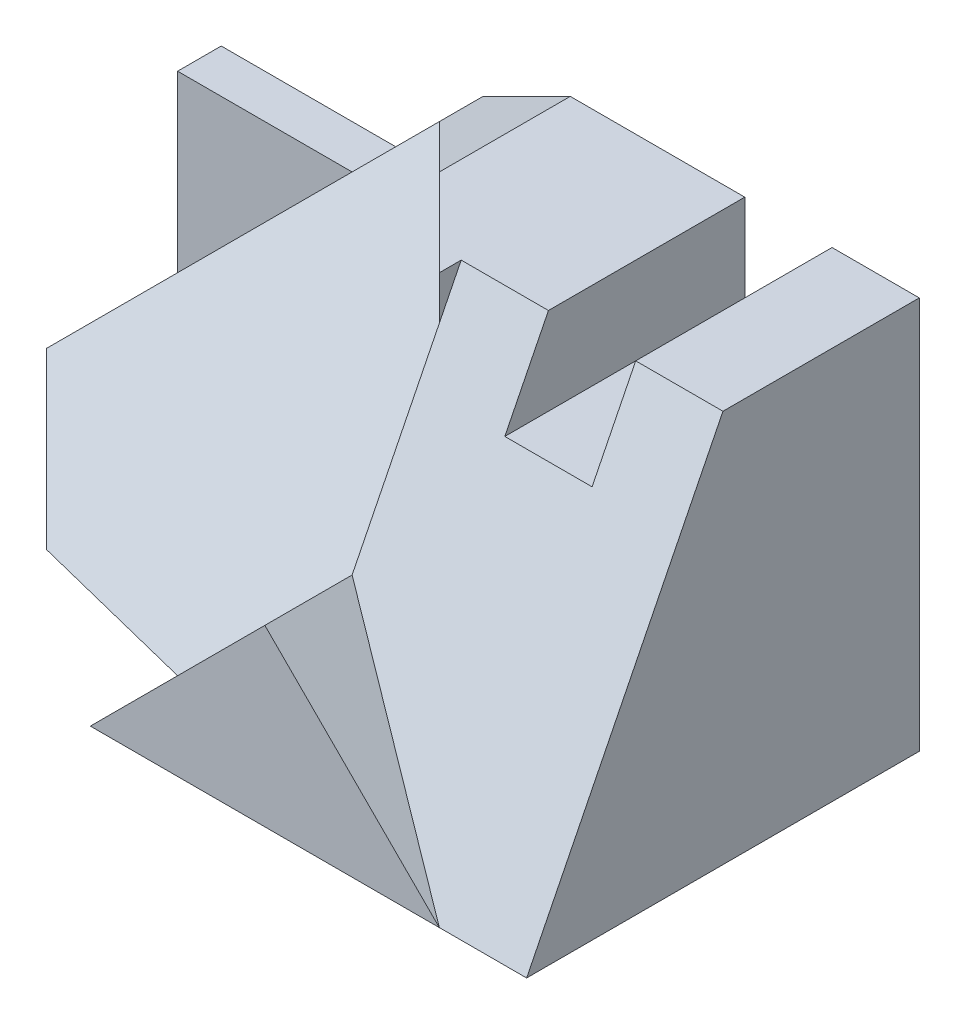
ISO-10303-21;
HEADER;
FILE_DESCRIPTION(('STEP AP214'),'2;1');
FILE_NAME('part.step','',(''),(''),'','','');
FILE_SCHEMA(('AUTOMOTIVE_DESIGN { 1 0 10303 214 1 1 1 1 }'));
ENDSEC;
DATA;
#1=APPLICATION_CONTEXT('core data for automotive mechanical design processes');
#2=APPLICATION_PROTOCOL_DEFINITION('international standard','automotive_design',2000,#1);
#3=PRODUCT_CONTEXT('',#1,'mechanical');
#4=PRODUCT('Part','Part','',(#3));
#5=PRODUCT_RELATED_PRODUCT_CATEGORY('part','',(#4));
#6=PRODUCT_DEFINITION_FORMATION('','',#4);
#7=PRODUCT_DEFINITION_CONTEXT('part definition',#1,'design');
#8=PRODUCT_DEFINITION('design','',#6,#7);
#9=PRODUCT_DEFINITION_SHAPE('','',#8);
#10=(LENGTH_UNIT() NAMED_UNIT(*) SI_UNIT(.MILLI.,.METRE.));
#11=(NAMED_UNIT(*) PLANE_ANGLE_UNIT() SI_UNIT($,.RADIAN.));
#12=(NAMED_UNIT(*) SI_UNIT($,.STERADIAN.) SOLID_ANGLE_UNIT());
#13=UNCERTAINTY_MEASURE_WITH_UNIT(LENGTH_MEASURE(1.E-05),#10,'distance_accuracy_value','');
#14=(GEOMETRIC_REPRESENTATION_CONTEXT(3) GLOBAL_UNCERTAINTY_ASSIGNED_CONTEXT((#13)) GLOBAL_UNIT_ASSIGNED_CONTEXT((#10,
#11,#12)) REPRESENTATION_CONTEXT('',''));
#15=CARTESIAN_POINT('',(0.,0.,0.));
#16=DIRECTION('',(0.,0.,1.));
#17=DIRECTION('',(1.,0.,0.));
#18=AXIS2_PLACEMENT_3D('',#15,#16,#17);
#19=CARTESIAN_POINT('',(0.,9.,4.5));
#20=DIRECTION('',(0.,0.,-1.));
#21=DIRECTION('',(-1.,0.,0.));
#22=AXIS2_PLACEMENT_3D('',#19,#20,#21);
#23=PLANE('',#22);
#24=DIRECTION('',(0.707106781186548,0.707106781186548,0.));
#25=VECTOR('',#24,1.);
#26=CARTESIAN_POINT('',(-2.,0.,4.5));
#27=LINE('',#26,#25);
#28=CARTESIAN_POINT('',(-2.,0.,4.5));
#29=VERTEX_POINT('',#28);
#30=CARTESIAN_POINT('',(2.,4.,4.5));
#31=VERTEX_POINT('',#30);
#32=EDGE_CURVE('E261',#29,#31,#27,.T.);
#33=ORIENTED_EDGE('',*,*,#32,.F.);
#34=DIRECTION('',(1.,0.,0.));
#35=VECTOR('',#34,1.);
#36=CARTESIAN_POINT('',(0.,0.,4.5));
#37=LINE('',#36,#35);
#38=CARTESIAN_POINT('',(6.,0.,4.5));
#39=VERTEX_POINT('',#38);
#40=EDGE_CURVE('E206',#29,#39,#37,.T.);
#41=ORIENTED_EDGE('',*,*,#40,.T.);
#42=DIRECTION('',(0.707106781186548,-0.707106781186548,0.));
#43=VECTOR('',#42,1.);
#44=CARTESIAN_POINT('',(-1.5,7.5,4.5));
#45=LINE('',#44,#43);
#46=EDGE_CURVE('E260',#31,#39,#45,.T.);
#47=ORIENTED_EDGE('',*,*,#46,.F.);
#48=EDGE_LOOP('',(#33,#41,#47));
#49=FACE_BOUND('',#48,.T.);
#50=ADVANCED_FACE('F38',(#49),#23,.F.);
#51=CARTESIAN_POINT('',(0.,9.,0.));
#52=DIRECTION('',(0.,1.,0.));
#53=DIRECTION('',(0.,0.,1.));
#54=AXIS2_PLACEMENT_3D('',#51,#52,#53);
#55=PLANE('',#54);
#56=DIRECTION('',(0.,0.,1.));
#57=VECTOR('',#56,1.);
#58=CARTESIAN_POINT('',(6.,9.,-4.5));
#59=LINE('',#58,#57);
#60=CARTESIAN_POINT('',(6.,9.,-4.5));
#61=VERTEX_POINT('',#60);
#62=CARTESIAN_POINT('',(6.,9.,0.));
#63=VERTEX_POINT('',#62);
#64=EDGE_CURVE('E357',#61,#63,#59,.T.);
#65=ORIENTED_EDGE('',*,*,#64,.T.);
#66=DIRECTION('',(1.,0.,0.));
#67=VECTOR('',#66,1.);
#68=CARTESIAN_POINT('',(2.,9.,0.));
#69=LINE('',#68,#67);
#70=CARTESIAN_POINT('',(8.,9.,0.));
#71=VERTEX_POINT('',#70);
#72=EDGE_CURVE('E295',#63,#71,#69,.T.);
#73=ORIENTED_EDGE('',*,*,#72,.T.);
#74=DIRECTION('',(0.,0.,-1.));
#75=VECTOR('',#74,1.);
#76=CARTESIAN_POINT('',(8.,9.,0.));
#77=LINE('',#76,#75);
#78=CARTESIAN_POINT('',(8.,9.,-4.5));
#79=VERTEX_POINT('',#78);
#80=EDGE_CURVE('E243',#71,#79,#77,.T.);
#81=ORIENTED_EDGE('',*,*,#80,.T.);
#82=DIRECTION('',(1.,0.,0.));
#83=VECTOR('',#82,1.);
#84=CARTESIAN_POINT('',(0.,9.,-4.5));
#85=LINE('',#84,#83);
#86=EDGE_CURVE('E240',#61,#79,#85,.T.);
#87=ORIENTED_EDGE('',*,*,#86,.F.);
#88=EDGE_LOOP('',(#65,#73,#81,#87));
#89=FACE_BOUND('',#88,.T.);
#90=ADVANCED_FACE('F393',(#89),#55,.T.);
#91=CARTESIAN_POINT('',(8.,9.,0.));
#92=DIRECTION('',(-1.,0.,0.));
#93=DIRECTION('',(0.,0.,1.));
#94=AXIS2_PLACEMENT_3D('',#91,#92,#93);
#95=PLANE('',#94);
#96=DIRECTION('',(0.,-0.894427190999916,0.447213595499958));
#97=VECTOR('',#96,1.);
#98=CARTESIAN_POINT('',(8.,9.,0.));
#99=LINE('',#98,#97);
#100=CARTESIAN_POINT('',(8.,0.,4.5));
#101=VERTEX_POINT('',#100);
#102=EDGE_CURVE('E268',#71,#101,#99,.T.);
#103=ORIENTED_EDGE('',*,*,#102,.T.);
#104=DIRECTION('',(0.,0.,-1.));
#105=VECTOR('',#104,1.);
#106=CARTESIAN_POINT('',(8.,0.,0.));
#107=LINE('',#106,#105);
#108=CARTESIAN_POINT('',(8.,0.,-4.5));
#109=VERTEX_POINT('',#108);
#110=EDGE_CURVE('E247',#101,#109,#107,.T.);
#111=ORIENTED_EDGE('',*,*,#110,.T.);
#112=DIRECTION('',(0.,-1.,0.));
#113=VECTOR('',#112,1.);
#114=CARTESIAN_POINT('',(8.,9.,-4.5));
#115=LINE('',#114,#113);
#116=EDGE_CURVE('E46',#79,#109,#115,.T.);
#117=ORIENTED_EDGE('',*,*,#116,.F.);
#118=ORIENTED_EDGE('',*,*,#80,.F.);
#119=EDGE_LOOP('',(#103,#111,#117,#118));
#120=FACE_BOUND('',#119,.T.);
#121=ADVANCED_FACE('F392',(#120),#95,.F.);
#122=DIRECTION('',(-0.707106781186548,0.,-0.707106781186548));
#123=VECTOR('',#122,1.);
#124=CARTESIAN_POINT('',(0.75,9.,-0.75));
#125=LINE('',#124,#123);
#126=CARTESIAN_POINT('',(2.,9.,0.5));
#127=VERTEX_POINT('',#126);
#128=CARTESIAN_POINT('',(0.,9.,-1.5));
#129=VERTEX_POINT('',#128);
#130=EDGE_CURVE('E163',#127,#129,#125,.T.);
#131=ORIENTED_EDGE('',*,*,#130,.F.);
#132=DIRECTION('',(0.,0.,1.));
#133=VECTOR('',#132,1.);
#134=CARTESIAN_POINT('',(2.,9.,0.));
#135=LINE('',#134,#133);
#136=CARTESIAN_POINT('',(2.,9.,0.));
#137=VERTEX_POINT('',#136);
#138=EDGE_CURVE('E291',#137,#127,#135,.T.);
#139=ORIENTED_EDGE('',*,*,#138,.F.);
#140=CARTESIAN_POINT('',(4.,9.,0.));
#141=VERTEX_POINT('',#140);
#142=EDGE_CURVE('E285',#137,#141,#69,.T.);
#143=ORIENTED_EDGE('',*,*,#142,.T.);
#144=DIRECTION('',(0.,0.,1.));
#145=VECTOR('',#144,1.);
#146=CARTESIAN_POINT('',(4.,9.,-4.5));
#147=LINE('',#146,#145);
#148=CARTESIAN_POINT('',(4.,9.,-4.5));
#149=VERTEX_POINT('',#148);
#150=EDGE_CURVE('E349',#149,#141,#147,.T.);
#151=ORIENTED_EDGE('',*,*,#150,.F.);
#152=CARTESIAN_POINT('',(0.,9.,-4.5));
#153=VERTEX_POINT('',#152);
#154=EDGE_CURVE('E381',#153,#149,#85,.T.);
#155=ORIENTED_EDGE('',*,*,#154,.F.);
#156=DIRECTION('',(0.,0.,1.));
#157=VECTOR('',#156,1.);
#158=CARTESIAN_POINT('',(0.,9.,-4.5));
#159=LINE('',#158,#157);
#160=EDGE_CURVE('E189',#153,#129,#159,.T.);
#161=ORIENTED_EDGE('',*,*,#160,.T.);
#162=EDGE_LOOP('',(#131,#139,#143,#151,#155,#161));
#163=FACE_BOUND('',#162,.T.);
#164=ADVANCED_FACE('F342',(#163),#55,.T.);
#165=CARTESIAN_POINT('',(6.,9.,-4.5));
#166=DIRECTION('',(1.,0.,0.));
#167=DIRECTION('',(0.,0.,-1.));
#168=AXIS2_PLACEMENT_3D('',#165,#166,#167);
#169=PLANE('',#168);
#170=DIRECTION('',(0.,-0.894427190999916,0.447213595499958));
#171=VECTOR('',#170,1.);
#172=CARTESIAN_POINT('',(6.,10.8,-0.899999999999999));
#173=LINE('',#172,#171);
#174=CARTESIAN_POINT('',(6.,7.,1.));
#175=VERTEX_POINT('',#174);
#176=EDGE_CURVE('E395',#63,#175,#173,.T.);
#177=ORIENTED_EDGE('',*,*,#176,.F.);
#178=ORIENTED_EDGE('',*,*,#64,.F.);
#179=DIRECTION('',(0.,1.,0.));
#180=VECTOR('',#179,1.);
#181=CARTESIAN_POINT('',(6.,9.,-4.5));
#182=LINE('',#181,#180);
#183=CARTESIAN_POINT('',(6.,7.,-4.5));
#184=VERTEX_POINT('',#183);
#185=EDGE_CURVE('E192',#184,#61,#182,.T.);
#186=ORIENTED_EDGE('',*,*,#185,.F.);
#187=DIRECTION('',(0.,0.,1.));
#188=VECTOR('',#187,1.);
#189=CARTESIAN_POINT('',(6.,7.,-4.5));
#190=LINE('',#189,#188);
#191=EDGE_CURVE('E219',#184,#175,#190,.T.);
#192=ORIENTED_EDGE('',*,*,#191,.T.);
#193=EDGE_LOOP('',(#177,#178,#186,#192));
#194=FACE_BOUND('',#193,.T.);
#195=ADVANCED_FACE('F398',(#194),#169,.F.);
#196=CARTESIAN_POINT('',(6.,7.,-4.5));
#197=DIRECTION('',(0.,-1.,0.));
#198=DIRECTION('',(1.,0.,0.));
#199=AXIS2_PLACEMENT_3D('',#196,#197,#198);
#200=PLANE('',#199);
#201=DIRECTION('',(-1.,0.,0.));
#202=VECTOR('',#201,1.);
#203=CARTESIAN_POINT('',(6.,7.,1.));
#204=LINE('',#203,#202);
#205=CARTESIAN_POINT('',(4.,7.,1.));
#206=VERTEX_POINT('',#205);
#207=EDGE_CURVE('E53',#175,#206,#204,.T.);
#208=ORIENTED_EDGE('',*,*,#207,.F.);
#209=ORIENTED_EDGE('',*,*,#191,.F.);
#210=DIRECTION('',(1.,0.,0.));
#211=VECTOR('',#210,1.);
#212=CARTESIAN_POINT('',(6.,7.,-4.5));
#213=LINE('',#212,#211);
#214=CARTESIAN_POINT('',(4.,7.,-4.5));
#215=VERTEX_POINT('',#214);
#216=EDGE_CURVE('E361',#215,#184,#213,.T.);
#217=ORIENTED_EDGE('',*,*,#216,.F.);
#218=DIRECTION('',(0.,0.,1.));
#219=VECTOR('',#218,1.);
#220=CARTESIAN_POINT('',(4.,7.,-4.5));
#221=LINE('',#220,#219);
#222=EDGE_CURVE('E356',#215,#206,#221,.T.);
#223=ORIENTED_EDGE('',*,*,#222,.T.);
#224=EDGE_LOOP('',(#208,#209,#217,#223));
#225=FACE_BOUND('',#224,.T.);
#226=ADVANCED_FACE('F410',(#225),#200,.F.);
#227=CARTESIAN_POINT('',(4.,9.,-4.5));
#228=DIRECTION('',(-1.,0.,0.));
#229=DIRECTION('',(0.,-1.,0.));
#230=AXIS2_PLACEMENT_3D('',#227,#228,#229);
#231=PLANE('',#230);
#232=DIRECTION('',(0.,0.894427190999916,-0.447213595499958));
#233=VECTOR('',#232,1.);
#234=CARTESIAN_POINT('',(4.,10.8,-0.899999999999999));
#235=LINE('',#234,#233);
#236=EDGE_CURVE('E12',#206,#141,#235,.T.);
#237=ORIENTED_EDGE('',*,*,#236,.F.);
#238=ORIENTED_EDGE('',*,*,#222,.F.);
#239=DIRECTION('',(0.,-1.,0.));
#240=VECTOR('',#239,1.);
#241=CARTESIAN_POINT('',(4.,9.,-4.5));
#242=LINE('',#241,#240);
#243=EDGE_CURVE('E355',#149,#215,#242,.T.);
#244=ORIENTED_EDGE('',*,*,#243,.F.);
#245=ORIENTED_EDGE('',*,*,#150,.T.);
#246=EDGE_LOOP('',(#237,#238,#244,#245));
#247=FACE_BOUND('',#246,.T.);
#248=ADVANCED_FACE('F352',(#247),#231,.F.);
#249=CARTESIAN_POINT('',(-8.,9.,0.));
#250=DIRECTION('',(-1.,0.,0.));
#251=DIRECTION('',(0.,0.,1.));
#252=AXIS2_PLACEMENT_3D('',#249,#250,#251);
#253=PLANE('',#252);
#254=DIRECTION('',(0.,0.,1.));
#255=VECTOR('',#254,1.);
#256=CARTESIAN_POINT('',(-8.,2.,-4.5));
#257=LINE('',#256,#255);
#258=CARTESIAN_POINT('',(-8.,2.,-4.5));
#259=VERTEX_POINT('',#258);
#260=CARTESIAN_POINT('',(-8.,2.,-3.5));
#261=VERTEX_POINT('',#260);
#262=EDGE_CURVE('E223',#259,#261,#257,.T.);
#263=ORIENTED_EDGE('',*,*,#262,.T.);
#264=DIRECTION('',(0.,-1.,0.));
#265=VECTOR('',#264,1.);
#266=CARTESIAN_POINT('',(-8.,2.,-3.5));
#267=LINE('',#266,#265);
#268=CARTESIAN_POINT('',(-8.,6.,-3.5));
#269=VERTEX_POINT('',#268);
#270=EDGE_CURVE('E378',#269,#261,#267,.T.);
#271=ORIENTED_EDGE('',*,*,#270,.F.);
#272=DIRECTION('',(0.,0.,1.));
#273=VECTOR('',#272,1.);
#274=CARTESIAN_POINT('',(-8.,6.,-4.5));
#275=LINE('',#274,#273);
#276=CARTESIAN_POINT('',(-8.,6.,-4.5));
#277=VERTEX_POINT('',#276);
#278=EDGE_CURVE('E195',#277,#269,#275,.T.);
#279=ORIENTED_EDGE('',*,*,#278,.F.);
#280=DIRECTION('',(0.,-1.,0.));
#281=VECTOR('',#280,1.);
#282=CARTESIAN_POINT('',(-8.,9.,-4.5));
#283=LINE('',#282,#281);
#284=EDGE_CURVE('E377',#277,#259,#283,.T.);
#285=ORIENTED_EDGE('',*,*,#284,.T.);
#286=EDGE_LOOP('',(#263,#271,#279,#285));
#287=FACE_BOUND('',#286,.T.);
#288=ADVANCED_FACE('F376',(#287),#253,.T.);
#289=CARTESIAN_POINT('',(-8.,6.,-4.5));
#290=DIRECTION('',(0.,-1.,0.));
#291=DIRECTION('',(0.,0.,-1.));
#292=AXIS2_PLACEMENT_3D('',#289,#290,#291);
#293=PLANE('',#292);
#294=DIRECTION('',(-1.,0.,0.));
#295=VECTOR('',#294,1.);
#296=CARTESIAN_POINT('',(-8.,6.,-3.5));
#297=LINE('',#296,#295);
#298=CARTESIAN_POINT('',(-4.,6.,-3.5));
#299=VERTEX_POINT('',#298);
#300=EDGE_CURVE('E373',#299,#269,#297,.T.);
#301=ORIENTED_EDGE('',*,*,#300,.F.);
#302=DIRECTION('',(0.,0.,1.));
#303=VECTOR('',#302,1.);
#304=CARTESIAN_POINT('',(-4.,6.,-4.5));
#305=LINE('',#304,#303);
#306=CARTESIAN_POINT('',(-4.,6.,-4.5));
#307=VERTEX_POINT('',#306);
#308=EDGE_CURVE('E190',#307,#299,#305,.T.);
#309=ORIENTED_EDGE('',*,*,#308,.F.);
#310=DIRECTION('',(1.,0.,0.));
#311=VECTOR('',#310,1.);
#312=CARTESIAN_POINT('',(-8.,6.,-4.5));
#313=LINE('',#312,#311);
#314=EDGE_CURVE('E228',#277,#307,#313,.T.);
#315=ORIENTED_EDGE('',*,*,#314,.F.);
#316=ORIENTED_EDGE('',*,*,#278,.T.);
#317=EDGE_LOOP('',(#301,#309,#315,#316));
#318=FACE_BOUND('',#317,.T.);
#319=ADVANCED_FACE('F372',(#318),#293,.F.);
#320=CARTESIAN_POINT('',(0.,9.,-4.5));
#321=DIRECTION('',(0.,0.,-1.));
#322=DIRECTION('',(-1.,0.,0.));
#323=AXIS2_PLACEMENT_3D('',#320,#321,#322);
#324=PLANE('',#323);
#325=ORIENTED_EDGE('',*,*,#185,.T.);
#326=ORIENTED_EDGE('',*,*,#86,.T.);
#327=ORIENTED_EDGE('',*,*,#116,.T.);
#328=DIRECTION('',(1.,0.,0.));
#329=VECTOR('',#328,1.);
#330=CARTESIAN_POINT('',(0.,0.,-4.5));
#331=LINE('',#330,#329);
#332=CARTESIAN_POINT('',(-6.,0.,-4.5));
#333=VERTEX_POINT('',#332);
#334=EDGE_CURVE('E246',#333,#109,#331,.T.);
#335=ORIENTED_EDGE('',*,*,#334,.F.);
#336=DIRECTION('',(-0.707106781186548,0.707106781186548,0.));
#337=VECTOR('',#336,1.);
#338=CARTESIAN_POINT('',(-8.,2.,-4.5));
#339=LINE('',#338,#337);
#340=EDGE_CURVE('E215',#333,#259,#339,.T.);
#341=ORIENTED_EDGE('',*,*,#340,.T.);
#342=ORIENTED_EDGE('',*,*,#284,.F.);
#343=ORIENTED_EDGE('',*,*,#314,.T.);
#344=DIRECTION('',(0.707106781186548,0.707106781186548,0.));
#345=VECTOR('',#344,1.);
#346=CARTESIAN_POINT('',(-4.,6.,-4.5));
#347=LINE('',#346,#345);
#348=CARTESIAN_POINT('',(-2.,8.,-4.5));
#349=VERTEX_POINT('',#348);
#350=EDGE_CURVE('E367',#307,#349,#347,.T.);
#351=ORIENTED_EDGE('',*,*,#350,.T.);
#352=DIRECTION('',(0.894427190999916,0.447213595499958,0.));
#353=VECTOR('',#352,1.);
#354=CARTESIAN_POINT('',(-2.,8.,-4.5));
#355=LINE('',#354,#353);
#356=EDGE_CURVE('E187',#349,#153,#355,.T.);
#357=ORIENTED_EDGE('',*,*,#356,.T.);
#358=ORIENTED_EDGE('',*,*,#154,.T.);
#359=ORIENTED_EDGE('',*,*,#243,.T.);
#360=ORIENTED_EDGE('',*,*,#216,.T.);
#361=EDGE_LOOP('',(#325,#326,#327,#335,#341,#342,#343,#351,#357,#358,#359,#360));
#362=FACE_BOUND('',#361,.T.);
#363=ADVANCED_FACE('F380',(#362),#324,.T.);
#364=CARTESIAN_POINT('',(0.,0.,0.));
#365=DIRECTION('',(0.,1.,0.));
#366=DIRECTION('',(0.,0.,1.));
#367=AXIS2_PLACEMENT_3D('',#364,#365,#366);
#368=PLANE('',#367);
#369=DIRECTION('',(0.970142500145332,0.,0.242535625036333));
#370=VECTOR('',#369,1.);
#371=CARTESIAN_POINT('',(-0.705882352941176,0.,2.82352941176471));
#372=LINE('',#371,#370);
#373=CARTESIAN_POINT('',(-6.,0.,1.5));
#374=VERTEX_POINT('',#373);
#375=CARTESIAN_POINT('',(-2.,0.,2.5));
#376=VERTEX_POINT('',#375);
#377=EDGE_CURVE('E207',#374,#376,#372,.T.);
#378=ORIENTED_EDGE('',*,*,#377,.F.);
#379=DIRECTION('',(0.,0.,1.));
#380=VECTOR('',#379,1.);
#381=CARTESIAN_POINT('',(-6.,0.,-4.5));
#382=LINE('',#381,#380);
#383=EDGE_CURVE('E221',#333,#374,#382,.T.);
#384=ORIENTED_EDGE('',*,*,#383,.F.);
#385=ORIENTED_EDGE('',*,*,#334,.T.);
#386=ORIENTED_EDGE('',*,*,#110,.F.);
#387=DIRECTION('',(-1.,0.,0.));
#388=VECTOR('',#387,1.);
#389=CARTESIAN_POINT('',(8.,0.,4.5));
#390=LINE('',#389,#388);
#391=EDGE_CURVE('E266',#101,#39,#390,.T.);
#392=ORIENTED_EDGE('',*,*,#391,.T.);
#393=ORIENTED_EDGE('',*,*,#40,.F.);
#394=DIRECTION('',(0.,0.,1.));
#395=VECTOR('',#394,1.);
#396=CARTESIAN_POINT('',(-2.,0.,0.));
#397=LINE('',#396,#395);
#398=EDGE_CURVE('E204',#376,#29,#397,.T.);
#399=ORIENTED_EDGE('',*,*,#398,.F.);
#400=EDGE_LOOP('',(#378,#384,#385,#386,#392,#393,#399));
#401=FACE_BOUND('',#400,.T.);
#402=ADVANCED_FACE('F265',(#401),#368,.F.);
#403=CARTESIAN_POINT('',(-8.,2.,-4.5));
#404=DIRECTION('',(0.707106781186547,0.707106781186547,0.));
#405=DIRECTION('',(-0.707106781186548,0.707106781186548,0.));
#406=AXIS2_PLACEMENT_3D('',#403,#404,#405);
#407=PLANE('',#406);
#408=ORIENTED_EDGE('',*,*,#262,.F.);
#409=ORIENTED_EDGE('',*,*,#340,.F.);
#410=ORIENTED_EDGE('',*,*,#383,.T.);
#411=DIRECTION('',(0.577350269189626,-0.577350269189626,0.577350269189626));
#412=VECTOR('',#411,1.);
#413=CARTESIAN_POINT('',(-7.5,1.5,0.));
#414=LINE('',#413,#412);
#415=CARTESIAN_POINT('',(-8.,2.,-0.500000000000001));
#416=VERTEX_POINT('',#415);
#417=EDGE_CURVE('E211',#416,#374,#414,.T.);
#418=ORIENTED_EDGE('',*,*,#417,.F.);
#419=DIRECTION('',(0.,0.,1.));
#420=VECTOR('',#419,1.);
#421=CARTESIAN_POINT('',(-8.,2.,-3.5));
#422=LINE('',#421,#420);
#423=EDGE_CURVE('E182',#261,#416,#422,.T.);
#424=ORIENTED_EDGE('',*,*,#423,.F.);
#425=EDGE_LOOP('',(#408,#409,#410,#418,#424));
#426=FACE_BOUND('',#425,.T.);
#427=ADVANCED_FACE('F447',(#426),#407,.F.);
#428=CARTESIAN_POINT('',(-4.,6.,-4.5));
#429=DIRECTION('',(0.707106781186547,-0.707106781186547,0.));
#430=DIRECTION('',(0.707106781186548,0.707106781186548,0.));
#431=AXIS2_PLACEMENT_3D('',#428,#429,#430);
#432=PLANE('',#431);
#433=ORIENTED_EDGE('',*,*,#423,.T.);
#434=DIRECTION('',(-0.666666666666667,-0.666666666666667,0.333333333333333));
#435=VECTOR('',#434,1.);
#436=CARTESIAN_POINT('',(-2.,8.,-3.5));
#437=LINE('',#436,#435);
#438=CARTESIAN_POINT('',(-2.,8.,-3.5));
#439=VERTEX_POINT('',#438);
#440=EDGE_CURVE('E171',#439,#416,#437,.T.);
#441=ORIENTED_EDGE('',*,*,#440,.F.);
#442=DIRECTION('',(0.,0.,1.));
#443=VECTOR('',#442,1.);
#444=CARTESIAN_POINT('',(-2.,8.,-4.5));
#445=LINE('',#444,#443);
#446=EDGE_CURVE('E179',#349,#439,#445,.T.);
#447=ORIENTED_EDGE('',*,*,#446,.F.);
#448=ORIENTED_EDGE('',*,*,#350,.F.);
#449=ORIENTED_EDGE('',*,*,#308,.T.);
#450=DIRECTION('',(0.707106781186548,0.707106781186548,0.));
#451=VECTOR('',#450,1.);
#452=CARTESIAN_POINT('',(-4.,6.,-3.5));
#453=LINE('',#452,#451);
#454=EDGE_CURVE('E61',#261,#299,#453,.T.);
#455=ORIENTED_EDGE('',*,*,#454,.F.);
#456=EDGE_LOOP('',(#433,#441,#447,#448,#449,#455));
#457=FACE_BOUND('',#456,.T.);
#458=ADVANCED_FACE('F177',(#457),#432,.F.);
#459=CARTESIAN_POINT('',(-2.,8.,-4.5));
#460=DIRECTION('',(0.447213595499958,-0.894427190999916,0.));
#461=DIRECTION('',(0.894427190999916,0.447213595499958,0.));
#462=AXIS2_PLACEMENT_3D('',#459,#460,#461);
#463=PLANE('',#462);
#464=ORIENTED_EDGE('',*,*,#446,.T.);
#465=DIRECTION('',(0.666666666666667,0.333333333333333,0.666666666666667));
#466=VECTOR('',#465,1.);
#467=CARTESIAN_POINT('',(-2.44444444444444,7.77777777777778,-3.94444444444444));
#468=LINE('',#467,#466);
#469=EDGE_CURVE('E157',#439,#129,#468,.T.);
#470=ORIENTED_EDGE('',*,*,#469,.T.);
#471=ORIENTED_EDGE('',*,*,#160,.F.);
#472=ORIENTED_EDGE('',*,*,#356,.F.);
#473=EDGE_LOOP('',(#464,#470,#471,#472));
#474=FACE_BOUND('',#473,.T.);
#475=ADVANCED_FACE('F185',(#474),#463,.F.);
#476=CARTESIAN_POINT('',(0.,0.,-3.5));
#477=DIRECTION('',(0.,0.,1.));
#478=DIRECTION('',(1.,0.,0.));
#479=AXIS2_PLACEMENT_3D('',#476,#477,#478);
#480=PLANE('',#479);
#481=ORIENTED_EDGE('',*,*,#300,.T.);
#482=ORIENTED_EDGE('',*,*,#270,.T.);
#483=ORIENTED_EDGE('',*,*,#454,.T.);
#484=EDGE_LOOP('',(#481,#482,#483));
#485=FACE_BOUND('',#484,.T.);
#486=ADVANCED_FACE('F465',(#485),#480,.T.);
#487=CARTESIAN_POINT('',(2.,4.,2.5));
#488=DIRECTION('',(1.,0.,0.));
#489=DIRECTION('',(0.,0.,-1.));
#490=AXIS2_PLACEMENT_3D('',#487,#488,#489);
#491=PLANE('',#490);
#492=DIRECTION('',(0.,1.,0.));
#493=VECTOR('',#492,1.);
#494=CARTESIAN_POINT('',(2.,4.,0.5));
#495=LINE('',#494,#493);
#496=CARTESIAN_POINT('',(2.,8.,0.5));
#497=VERTEX_POINT('',#496);
#498=EDGE_CURVE('E307',#497,#127,#495,.T.);
#499=ORIENTED_EDGE('',*,*,#498,.F.);
#500=DIRECTION('',(0.,0.894427190999916,-0.447213595499958));
#501=VECTOR('',#500,1.);
#502=CARTESIAN_POINT('',(2.,4.,2.5));
#503=LINE('',#502,#501);
#504=EDGE_CURVE('E199',#497,#137,#503,.T.);
#505=ORIENTED_EDGE('',*,*,#504,.T.);
#506=ORIENTED_EDGE('',*,*,#138,.T.);
#507=EDGE_LOOP('',(#499,#505,#506));
#508=FACE_BOUND('',#507,.T.);
#509=ADVANCED_FACE('F344',(#508),#491,.T.);
#510=CARTESIAN_POINT('',(6.,0.,4.5));
#511=DIRECTION('',(0.707106781186548,0.707106781186548,0.));
#512=DIRECTION('',(-0.707106781186548,0.707106781186548,0.));
#513=AXIS2_PLACEMENT_3D('',#510,#511,#512);
#514=PLANE('',#513);
#515=ORIENTED_EDGE('',*,*,#46,.T.);
#516=DIRECTION('',(-0.666666666666667,0.666666666666667,-0.333333333333333));
#517=VECTOR('',#516,1.);
#518=CARTESIAN_POINT('',(6.,0.,4.5));
#519=LINE('',#518,#517);
#520=CARTESIAN_POINT('',(2.,4.,2.5));
#521=VERTEX_POINT('',#520);
#522=EDGE_CURVE('E269',#39,#521,#519,.T.);
#523=ORIENTED_EDGE('',*,*,#522,.T.);
#524=DIRECTION('',(0.,0.,1.));
#525=VECTOR('',#524,1.);
#526=CARTESIAN_POINT('',(2.,4.,2.5));
#527=LINE('',#526,#525);
#528=EDGE_CURVE('E282',#521,#31,#527,.T.);
#529=ORIENTED_EDGE('',*,*,#528,.T.);
#530=EDGE_LOOP('',(#515,#523,#529));
#531=FACE_BOUND('',#530,.T.);
#532=ADVANCED_FACE('F441',(#531),#514,.T.);
#533=CARTESIAN_POINT('',(0.,1.8,3.6));
#534=DIRECTION('',(0.,0.447213595499958,0.894427190999916));
#535=DIRECTION('',(0.,-0.894427190999916,0.447213595499958));
#536=AXIS2_PLACEMENT_3D('',#533,#534,#535);
#537=PLANE('',#536);
#538=ORIENTED_EDGE('',*,*,#176,.T.);
#539=ORIENTED_EDGE('',*,*,#207,.T.);
#540=ORIENTED_EDGE('',*,*,#236,.T.);
#541=ORIENTED_EDGE('',*,*,#142,.F.);
#542=ORIENTED_EDGE('',*,*,#504,.F.);
#543=EDGE_CURVE('E273',#521,#497,#503,.T.);
#544=ORIENTED_EDGE('',*,*,#543,.F.);
#545=ORIENTED_EDGE('',*,*,#522,.F.);
#546=ORIENTED_EDGE('',*,*,#391,.F.);
#547=ORIENTED_EDGE('',*,*,#102,.F.);
#548=ORIENTED_EDGE('',*,*,#72,.F.);
#549=EDGE_LOOP('',(#538,#539,#540,#541,#542,#544,#545,#546,#547,#548));
#550=FACE_BOUND('',#549,.T.);
#551=ADVANCED_FACE('F346',(#550),#537,.T.);
#552=CARTESIAN_POINT('',(-0.999999999999999,0.999999999999999,0.));
#553=DIRECTION('',(-0.707106781186547,0.707106781186548,0.));
#554=DIRECTION('',(-0.707106781186548,-0.707106781186547,0.));
#555=AXIS2_PLACEMENT_3D('',#552,#553,#554);
#556=PLANE('',#555);
#557=DIRECTION('',(-0.666666666666667,-0.666666666666667,0.333333333333333));
#558=VECTOR('',#557,1.);
#559=CARTESIAN_POINT('',(2.,4.,0.5));
#560=LINE('',#559,#558);
#561=CARTESIAN_POINT('',(2.,4.,0.5));
#562=VERTEX_POINT('',#561);
#563=EDGE_CURVE('E174',#562,#376,#560,.T.);
#564=ORIENTED_EDGE('',*,*,#563,.T.);
#565=ORIENTED_EDGE('',*,*,#398,.T.);
#566=ORIENTED_EDGE('',*,*,#32,.T.);
#567=ORIENTED_EDGE('',*,*,#528,.F.);
#568=DIRECTION('',(0.,0.,-1.));
#569=VECTOR('',#568,1.);
#570=CARTESIAN_POINT('',(2.,4.,4.5));
#571=LINE('',#570,#569);
#572=EDGE_CURVE('E311',#521,#562,#571,.T.);
#573=ORIENTED_EDGE('',*,*,#572,.T.);
#574=EDGE_LOOP('',(#564,#565,#566,#567,#573));
#575=FACE_BOUND('',#574,.T.);
#576=ADVANCED_FACE('F333',(#575),#556,.T.);
#577=CARTESIAN_POINT('',(2.,4.,4.5));
#578=DIRECTION('',(1.,0.,0.));
#579=DIRECTION('',(0.,0.,-1.));
#580=AXIS2_PLACEMENT_3D('',#577,#578,#579);
#581=PLANE('',#580);
#582=ORIENTED_EDGE('',*,*,#543,.T.);
#583=EDGE_CURVE('E310',#562,#497,#495,.T.);
#584=ORIENTED_EDGE('',*,*,#583,.F.);
#585=ORIENTED_EDGE('',*,*,#572,.F.);
#586=EDGE_LOOP('',(#582,#584,#585));
#587=FACE_BOUND('',#586,.T.);
#588=ADVANCED_FACE('F336',(#587),#581,.F.);
#589=CARTESIAN_POINT('',(-0.461538461538461,1.38461538461539,1.84615384615385));
#590=DIRECTION('',(-0.196116135138184,0.588348405414552,0.784464540552736));
#591=DIRECTION('',(0.,-0.8,0.6));
#592=AXIS2_PLACEMENT_3D('',#589,#590,#591);
#593=PLANE('',#592);
#594=ORIENTED_EDGE('',*,*,#563,.F.);
#595=DIRECTION('',(-0.577350269189626,0.577350269189626,-0.577350269189626));
#596=VECTOR('',#595,1.);
#597=CARTESIAN_POINT('',(2.,4.,0.5));
#598=LINE('',#597,#596);
#599=EDGE_CURVE('E160',#562,#439,#598,.T.);
#600=ORIENTED_EDGE('',*,*,#599,.T.);
#601=ORIENTED_EDGE('',*,*,#440,.T.);
#602=ORIENTED_EDGE('',*,*,#417,.T.);
#603=ORIENTED_EDGE('',*,*,#377,.T.);
#604=EDGE_LOOP('',(#594,#600,#601,#602,#603));
#605=FACE_BOUND('',#604,.T.);
#606=ADVANCED_FACE('F170',(#605),#593,.T.);
#607=CARTESIAN_POINT('',(2.,4.,0.5));
#608=DIRECTION('',(0.707106781186547,0.,-0.707106781186547));
#609=DIRECTION('',(-0.707106781186548,0.,-0.707106781186548));
#610=AXIS2_PLACEMENT_3D('',#607,#608,#609);
#611=PLANE('',#610);
#612=ORIENTED_EDGE('',*,*,#130,.T.);
#613=ORIENTED_EDGE('',*,*,#469,.F.);
#614=ORIENTED_EDGE('',*,*,#599,.F.);
#615=ORIENTED_EDGE('',*,*,#583,.T.);
#616=ORIENTED_EDGE('',*,*,#498,.T.);
#617=EDGE_LOOP('',(#612,#613,#614,#615,#616));
#618=FACE_BOUND('',#617,.T.);
#619=ADVANCED_FACE('F159',(#618),#611,.F.);
#620=CLOSED_SHELL('',(#50,#90,#121,#164,#195,#226,#248,#288,#319,#363,#402,#427,#458,#475,#486,
#509,#532,#551,#576,#588,#606,#619));
#621=MANIFOLD_SOLID_BREP('B2',#620);
#622=ADVANCED_BREP_SHAPE_REPRESENTATION('',(#18,#621),#14);
#623=SHAPE_DEFINITION_REPRESENTATION(#9,#622);
ENDSEC;
END-ISO-10303-21;
